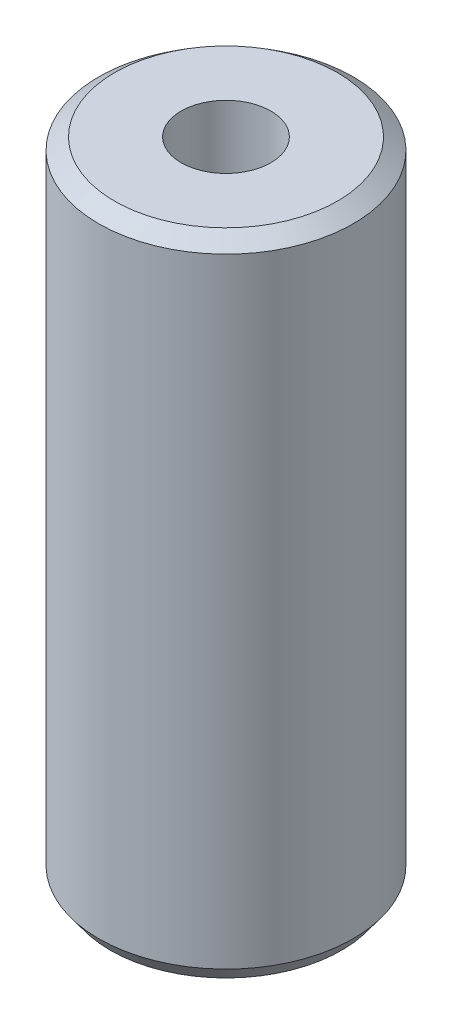
ISO-10303-21;
HEADER;
FILE_DESCRIPTION(('STEP AP214'),'2;1');
FILE_NAME('part.step','',(''),(''),'','','');
FILE_SCHEMA(('AUTOMOTIVE_DESIGN { 1 0 10303 214 1 1 1 1 }'));
ENDSEC;
DATA;
#1=APPLICATION_CONTEXT('core data for automotive mechanical design processes');
#2=APPLICATION_PROTOCOL_DEFINITION('international standard','automotive_design',2000,#1);
#3=PRODUCT_CONTEXT('',#1,'mechanical');
#4=PRODUCT('Part','Part','',(#3));
#5=PRODUCT_RELATED_PRODUCT_CATEGORY('part','',(#4));
#6=PRODUCT_DEFINITION_FORMATION('','',#4);
#7=PRODUCT_DEFINITION_CONTEXT('part definition',#1,'design');
#8=PRODUCT_DEFINITION('design','',#6,#7);
#9=PRODUCT_DEFINITION_SHAPE('','',#8);
#10=(LENGTH_UNIT() NAMED_UNIT(*) SI_UNIT(.MILLI.,.METRE.));
#11=(NAMED_UNIT(*) PLANE_ANGLE_UNIT() SI_UNIT($,.RADIAN.));
#12=(NAMED_UNIT(*) SI_UNIT($,.STERADIAN.) SOLID_ANGLE_UNIT());
#13=UNCERTAINTY_MEASURE_WITH_UNIT(LENGTH_MEASURE(1.E-05),#10,'distance_accuracy_value','');
#14=(GEOMETRIC_REPRESENTATION_CONTEXT(3) GLOBAL_UNCERTAINTY_ASSIGNED_CONTEXT((#13)) GLOBAL_UNIT_ASSIGNED_CONTEXT((#10,
#11,#12)) REPRESENTATION_CONTEXT('',''));
#15=CARTESIAN_POINT('',(0.,0.,0.));
#16=DIRECTION('',(0.,0.,1.));
#17=DIRECTION('',(1.,0.,0.));
#18=AXIS2_PLACEMENT_3D('',#15,#16,#17);
#19=CARTESIAN_POINT('',(0.,215.936897249652,0.));
#20=DIRECTION('',(0.,-1.,0.));
#21=DIRECTION('',(0.,0.,-1.));
#22=AXIS2_PLACEMENT_3D('',#19,#20,#21);
#23=CYLINDRICAL_SURFACE('',#22,42.5);
#24=CARTESIAN_POINT('',(0.,212.061658823815,0.));
#25=DIRECTION('',(0.,1.,0.));
#26=DIRECTION('',(0.,0.,1.));
#27=AXIS2_PLACEMENT_3D('',#24,#25,#26);
#28=CIRCLE('',#27,42.5);
#29=CARTESIAN_POINT('',(0.,212.061658823815,-42.5));
#30=VERTEX_POINT('',#29);
#31=EDGE_CURVE('E50',#30,#30,#28,.F.);
#32=ORIENTED_EDGE('',*,*,#31,.T.);
#33=EDGE_LOOP('',(#32));
#34=FACE_BOUND('',#33,.T.);
#35=CARTESIAN_POINT('',(0.,5.30370286387899,0.));
#36=DIRECTION('',(0.,1.,0.));
#37=DIRECTION('',(0.,0.,1.));
#38=AXIS2_PLACEMENT_3D('',#35,#36,#37);
#39=CIRCLE('',#38,42.5);
#40=CARTESIAN_POINT('',(0.,5.30370286387899,42.5));
#41=VERTEX_POINT('',#40);
#42=EDGE_CURVE('E51',#41,#41,#39,.T.);
#43=ORIENTED_EDGE('',*,*,#42,.T.);
#44=EDGE_LOOP('',(#43));
#45=FACE_BOUND('',#44,.T.);
#46=ADVANCED_FACE('F39',(#34,#45),#23,.T.);
#47=CARTESIAN_POINT('',(0.,215.936897249652,0.));
#48=DIRECTION('',(0.,1.,0.));
#49=DIRECTION('',(0.,0.,1.));
#50=AXIS2_PLACEMENT_3D('',#47,#48,#49);
#51=PLANE('',#50);
#52=CARTESIAN_POINT('',(0.,215.936897249652,0.));
#53=DIRECTION('',(0.,1.,0.));
#54=DIRECTION('',(0.,0.,1.));
#55=AXIS2_PLACEMENT_3D('',#52,#53,#54);
#56=CIRCLE('',#55,37.1962971361209);
#57=CARTESIAN_POINT('',(0.,215.936897249652,-37.1962971361209));
#58=VERTEX_POINT('',#57);
#59=EDGE_CURVE('E54',#58,#58,#56,.T.);
#60=ORIENTED_EDGE('',*,*,#59,.T.);
#61=EDGE_LOOP('',(#60));
#62=FACE_BOUND('',#61,.T.);
#63=CARTESIAN_POINT('',(0.,215.936897249652,0.));
#64=DIRECTION('',(0.,1.,0.));
#65=DIRECTION('',(0.,0.,1.));
#66=AXIS2_PLACEMENT_3D('',#63,#64,#65);
#67=CIRCLE('',#66,14.9753197250144);
#68=CARTESIAN_POINT('',(0.,215.936897249652,14.9753197250144));
#69=VERTEX_POINT('',#68);
#70=EDGE_CURVE('E58',#69,#69,#67,.T.);
#71=ORIENTED_EDGE('',*,*,#70,.F.);
#72=EDGE_LOOP('',(#71));
#73=FACE_BOUND('',#72,.T.);
#74=ADVANCED_FACE('F69',(#62,#73),#51,.T.);
#75=CARTESIAN_POINT('',(0.,0.,0.));
#76=DIRECTION('',(0.,1.,0.));
#77=DIRECTION('',(0.,0.,1.));
#78=AXIS2_PLACEMENT_3D('',#75,#76,#77);
#79=PLANE('',#78);
#80=CARTESIAN_POINT('',(0.,0.,0.));
#81=DIRECTION('',(0.,1.,0.));
#82=DIRECTION('',(0.,0.,1.));
#83=AXIS2_PLACEMENT_3D('',#80,#81,#82);
#84=CIRCLE('',#83,38.6247615741626);
#85=CARTESIAN_POINT('',(0.,0.,38.6247615741626));
#86=VERTEX_POINT('',#85);
#87=EDGE_CURVE('E10',#86,#86,#84,.F.);
#88=ORIENTED_EDGE('',*,*,#87,.T.);
#89=EDGE_LOOP('',(#88));
#90=FACE_BOUND('',#89,.T.);
#91=CARTESIAN_POINT('',(0.,0.,0.));
#92=DIRECTION('',(0.,1.,0.));
#93=DIRECTION('',(0.,0.,1.));
#94=AXIS2_PLACEMENT_3D('',#91,#92,#93);
#95=CIRCLE('',#94,14.9753197250144);
#96=CARTESIAN_POINT('',(0.,0.,14.9753197250144));
#97=VERTEX_POINT('',#96);
#98=EDGE_CURVE('E63',#97,#97,#95,.T.);
#99=ORIENTED_EDGE('',*,*,#98,.T.);
#100=EDGE_LOOP('',(#99));
#101=FACE_BOUND('',#100,.T.);
#102=ADVANCED_FACE('F75',(#90,#101),#79,.F.);
#103=CARTESIAN_POINT('',(0.,215.936897249652,0.));
#104=DIRECTION('',(0.,-1.,0.));
#105=DIRECTION('',(0.,0.,-1.));
#106=AXIS2_PLACEMENT_3D('',#103,#104,#105);
#107=CYLINDRICAL_SURFACE('',#106,14.9753197250144);
#108=ORIENTED_EDGE('',*,*,#70,.T.);
#109=EDGE_LOOP('',(#108));
#110=FACE_BOUND('',#109,.T.);
#111=ORIENTED_EDGE('',*,*,#98,.F.);
#112=EDGE_LOOP('',(#111));
#113=FACE_BOUND('',#112,.T.);
#114=ADVANCED_FACE('F70',(#110,#113),#107,.F.);
#115=CARTESIAN_POINT('',(0.,215.936897249652,0.));
#116=DIRECTION('',(0.,-1.,0.));
#117=DIRECTION('',(0.,0.,-1.));
#118=AXIS2_PLACEMENT_3D('',#115,#116,#117);
#119=CONICAL_SURFACE('',#118,37.1962971361209,0.93978385948934);
#120=CARTESIAN_POINT('',(0.,212.061658823815,-42.5));
#121=CARTESIAN_POINT('',(0.,212.102025890751,-42.444753095168));
#122=CARTESIAN_POINT('',(0.,212.142392957686,-42.3895061903359));
#123=CARTESIAN_POINT('',(0.,212.223127091558,-42.2790123806717));
#124=CARTESIAN_POINT('',(0.,212.263494158494,-42.2237654758397));
#125=CARTESIAN_POINT('',(0.,212.344228292366,-42.1132716661755));
#126=CARTESIAN_POINT('',(0.,212.384595359301,-42.0580247613434));
#127=CARTESIAN_POINT('',(0.,212.465329493173,-41.9475309516793));
#128=CARTESIAN_POINT('',(0.,212.505696560109,-41.8922840468472));
#129=CARTESIAN_POINT('',(0.,212.58643069398,-41.7817902371831));
#130=CARTESIAN_POINT('',(0.,212.626797760916,-41.726543332351));
#131=CARTESIAN_POINT('',(0.,212.707531894788,-41.6160495226869));
#132=CARTESIAN_POINT('',(0.,212.747898961724,-41.5608026178548));
#133=CARTESIAN_POINT('',(0.,212.828633095595,-41.4503088081906));
#134=CARTESIAN_POINT('',(0.,212.869000162531,-41.3950619033586));
#135=CARTESIAN_POINT('',(0.,212.949734296403,-41.2845680936944));
#136=CARTESIAN_POINT('',(0.,212.990101363338,-41.2293211888623));
#137=CARTESIAN_POINT('',(0.,213.07083549721,-41.1188273791982));
#138=CARTESIAN_POINT('',(0.,213.111202564146,-41.0635804743661));
#139=CARTESIAN_POINT('',(0.,213.191936698018,-40.9530866647019));
#140=CARTESIAN_POINT('',(0.,213.232303764953,-40.8978397598699));
#141=CARTESIAN_POINT('',(0.,213.313037898825,-40.7873459502057));
#142=CARTESIAN_POINT('',(0.,213.353404965761,-40.7320990453737));
#143=CARTESIAN_POINT('',(0.,213.434139099632,-40.6216052357095));
#144=CARTESIAN_POINT('',(0.,213.474506166568,-40.5663583308774));
#145=CARTESIAN_POINT('',(0.,213.55524030044,-40.4558645212133));
#146=CARTESIAN_POINT('',(0.,213.595607367376,-40.4006176163812));
#147=CARTESIAN_POINT('',(0.,213.676341501247,-40.2901238067171));
#148=CARTESIAN_POINT('',(0.,213.716708568183,-40.234876901885));
#149=CARTESIAN_POINT('',(0.,213.797442702055,-40.1243830922208));
#150=CARTESIAN_POINT('',(0.,213.83780976899,-40.0691361873888));
#151=CARTESIAN_POINT('',(0.,213.918543902862,-39.9586423777246));
#152=CARTESIAN_POINT('',(0.,213.958910969798,-39.9033954728925));
#153=CARTESIAN_POINT('',(0.,214.039645103669,-39.7929016632284));
#154=CARTESIAN_POINT('',(0.,214.080012170605,-39.7376547583963));
#155=CARTESIAN_POINT('',(0.,214.160746304477,-39.6271609487322));
#156=CARTESIAN_POINT('',(0.,214.201113371413,-39.5719140439001));
#157=CARTESIAN_POINT('',(0.,214.281847505284,-39.4614202342359));
#158=CARTESIAN_POINT('',(0.,214.32221457222,-39.4061733294039));
#159=CARTESIAN_POINT('',(0.,214.402948706092,-39.2956795197397));
#160=CARTESIAN_POINT('',(0.,214.443315773028,-39.2404326149077));
#161=CARTESIAN_POINT('',(0.,214.524049906899,-39.1299388052435));
#162=CARTESIAN_POINT('',(0.,214.564416973835,-39.0746919004114));
#163=CARTESIAN_POINT('',(0.,214.645151107707,-38.9641980907473));
#164=CARTESIAN_POINT('',(0.,214.685518174642,-38.9089511859152));
#165=CARTESIAN_POINT('',(0.,214.766252308514,-38.7984573762511));
#166=CARTESIAN_POINT('',(0.,214.80661937545,-38.743210471419));
#167=CARTESIAN_POINT('',(0.,214.887353509321,-38.6327166617548));
#168=CARTESIAN_POINT('',(0.,214.927720576257,-38.5774697569228));
#169=CARTESIAN_POINT('',(0.,215.008454710129,-38.4669759472586));
#170=CARTESIAN_POINT('',(0.,215.048821777065,-38.4117290424265));
#171=CARTESIAN_POINT('',(0.,215.129555910936,-38.3012352327624));
#172=CARTESIAN_POINT('',(0.,215.169922977872,-38.2459883279303));
#173=CARTESIAN_POINT('',(0.,215.250657111744,-38.1354945182662));
#174=CARTESIAN_POINT('',(0.,215.29102417868,-38.0802476134341));
#175=CARTESIAN_POINT('',(0.,215.371758312551,-37.9697538037699));
#176=CARTESIAN_POINT('',(0.,215.412125379487,-37.9145068989379));
#177=CARTESIAN_POINT('',(0.,215.492859513359,-37.8040130892737));
#178=CARTESIAN_POINT('',(0.,215.533226580294,-37.7487661844416));
#179=CARTESIAN_POINT('',(0.,215.613960714166,-37.6382723747775));
#180=CARTESIAN_POINT('',(0.,215.654327781102,-37.5830254699454));
#181=CARTESIAN_POINT('',(0.,215.735061914973,-37.4725316602813));
#182=CARTESIAN_POINT('',(0.,215.775428981909,-37.4172847554492));
#183=CARTESIAN_POINT('',(0.,215.856163115781,-37.306790945785));
#184=CARTESIAN_POINT('',(0.,215.896530182717,-37.251544040953));
#185=CARTESIAN_POINT('',(0.,215.936897249652,-37.1962971361209));
#186=B_SPLINE_CURVE_WITH_KNOTS('',3,(#120,#121,#122,#123,#124,#125,#126,#127,#128,#129,#130,
#131,#132,#133,#134,#135,#136,#137,#138,#139,#140,#141,#142,#143,#144,#145,#146,#147,#148,#149,
#150,#151,#152,#153,#154,#155,#156,#157,#158,#159,#160,#161,#162,#163,#164,#165,#166,#167,#168,
#169,#170,#171,#172,#173,#174,#175,#176,#177,#178,#179,#180,#181,#182,#183,#184,#185),
.UNSPECIFIED.,.F.,.F.,(4,2,2,2,2,2,2,2,2,2,2,2,2,2,2,2,2,2,2,2,2,2,2,2,2,2,2,2,2,2,2,2,4),(0.,
0.205269299406225,0.410538598812433,0.615807898218657,0.82107719762486,1.02634649703108,
1.23161579643729,1.43688509584352,1.64215439524973,1.84742369465595,2.05269299406216,
2.25796229346838,2.46323159287459,2.66850089228082,2.87377019168702,3.07903949109324,
3.28430879049945,3.48957808990566,3.69484738931188,3.90011668871809,4.10538598812432,
4.31065528753053,4.51592458693674,4.72119388634295,4.92646318574918,5.13173248515539,
5.33700178456161,5.54227108396782,5.74754038337404,5.95280968278025,6.15807898218648,
6.36334828159268,6.5686175809989),.UNSPECIFIED.);
#187=EDGE_CURVE('BSEAM81',#30,#58,#186,.T.);
#188=ORIENTED_EDGE('',*,*,#31,.F.);
#189=ORIENTED_EDGE('',*,*,#59,.F.);
#190=ORIENTED_EDGE('',*,*,#187,.T.);
#191=ORIENTED_EDGE('',*,*,#187,.F.);
#192=EDGE_LOOP('',(#188,#190,#189,#191));
#193=FACE_BOUND('',#192,.T.);
#194=ADVANCED_FACE('F81',(#193),#119,.T.);
#195=CARTESIAN_POINT('',(0.,5.30370286387899,0.));
#196=DIRECTION('',(0.,1.,0.));
#197=DIRECTION('',(0.,0.,1.));
#198=AXIS2_PLACEMENT_3D('',#195,#196,#197);
#199=CONICAL_SURFACE('',#198,42.5,0.631012467305556);
#200=ORIENTED_EDGE('',*,*,#87,.F.);
#201=EDGE_LOOP('',(#200));
#202=FACE_BOUND('',#201,.T.);
#203=ORIENTED_EDGE('',*,*,#42,.F.);
#204=EDGE_LOOP('',(#203));
#205=FACE_BOUND('',#204,.T.);
#206=ADVANCED_FACE('F45',(#202,#205),#199,.T.);
#207=CLOSED_SHELL('',(#46,#74,#102,#114,#194,#206));
#208=MANIFOLD_SOLID_BREP('B2',#207);
#209=ADVANCED_BREP_SHAPE_REPRESENTATION('',(#18,#208),#14);
#210=SHAPE_DEFINITION_REPRESENTATION(#9,#209);
ENDSEC;
END-ISO-10303-21;
